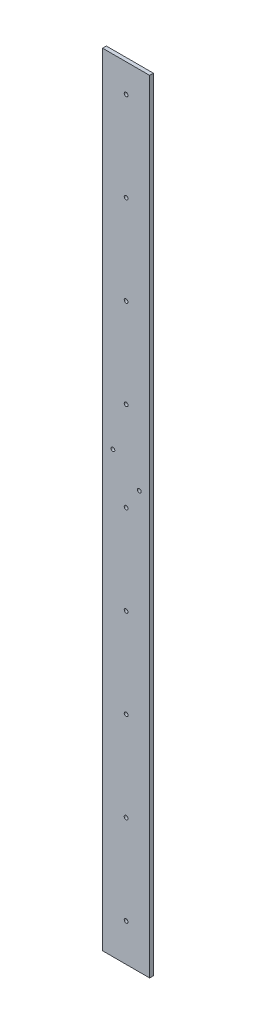
ISO-10303-21;
HEADER;
FILE_DESCRIPTION(('STEP AP214'),'2;1');
FILE_NAME('part.step','',(''),(''),'','','');
FILE_SCHEMA(('AUTOMOTIVE_DESIGN { 1 0 10303 214 1 1 1 1 }'));
ENDSEC;
DATA;
#1=APPLICATION_CONTEXT('core data for automotive mechanical design processes');
#2=APPLICATION_PROTOCOL_DEFINITION('international standard','automotive_design',2000,#1);
#3=PRODUCT_CONTEXT('',#1,'mechanical');
#4=PRODUCT('Part','Part','',(#3));
#5=PRODUCT_RELATED_PRODUCT_CATEGORY('part','',(#4));
#6=PRODUCT_DEFINITION_FORMATION('','',#4);
#7=PRODUCT_DEFINITION_CONTEXT('part definition',#1,'design');
#8=PRODUCT_DEFINITION('design','',#6,#7);
#9=PRODUCT_DEFINITION_SHAPE('','',#8);
#10=(LENGTH_UNIT() NAMED_UNIT(*) SI_UNIT(.MILLI.,.METRE.));
#11=(NAMED_UNIT(*) PLANE_ANGLE_UNIT() SI_UNIT($,.RADIAN.));
#12=(NAMED_UNIT(*) SI_UNIT($,.STERADIAN.) SOLID_ANGLE_UNIT());
#13=UNCERTAINTY_MEASURE_WITH_UNIT(LENGTH_MEASURE(1.E-05),#10,'distance_accuracy_value','');
#14=(GEOMETRIC_REPRESENTATION_CONTEXT(3) GLOBAL_UNCERTAINTY_ASSIGNED_CONTEXT((#13)) GLOBAL_UNIT_ASSIGNED_CONTEXT((#10,
#11,#12)) REPRESENTATION_CONTEXT('',''));
#15=CARTESIAN_POINT('',(0.,0.,0.));
#16=DIRECTION('',(0.,0.,1.));
#17=DIRECTION('',(1.,0.,0.));
#18=AXIS2_PLACEMENT_3D('',#15,#16,#17);
#19=CARTESIAN_POINT('',(-24.6280382553152,450.278971308513,4.));
#20=DIRECTION('',(1.,0.,0.));
#21=DIRECTION('',(0.,1.,0.));
#22=AXIS2_PLACEMENT_3D('',#19,#20,#21);
#23=PLANE('',#22);
#24=DIRECTION('',(0.,-1.,0.));
#25=VECTOR('',#24,1.);
#26=CARTESIAN_POINT('',(-24.6280382553152,450.278971308513,0.));
#27=LINE('',#26,#25);
#28=CARTESIAN_POINT('',(-24.6280382553152,450.278971308513,0.));
#29=VERTEX_POINT('',#28);
#30=CARTESIAN_POINT('',(-24.628038255312,-379.721028691487,0.));
#31=VERTEX_POINT('',#30);
#32=EDGE_CURVE('E82',#29,#31,#27,.T.);
#33=ORIENTED_EDGE('',*,*,#32,.T.);
#34=DIRECTION('',(0.,0.,1.));
#35=VECTOR('',#34,1.);
#36=CARTESIAN_POINT('',(-24.6280382553117,-379.721028691487,-0.00100000000000013));
#37=LINE('',#36,#35);
#38=CARTESIAN_POINT('',(-24.6280382553117,-379.721028691487,4.));
#39=VERTEX_POINT('',#38);
#40=EDGE_CURVE('E48',#31,#39,#37,.T.);
#41=ORIENTED_EDGE('',*,*,#40,.T.);
#42=DIRECTION('',(0.,-1.,0.));
#43=VECTOR('',#42,1.);
#44=CARTESIAN_POINT('',(-24.6280382553152,450.278971308513,4.));
#45=LINE('',#44,#43);
#46=CARTESIAN_POINT('',(-24.6280382553152,450.278971308513,4.));
#47=VERTEX_POINT('',#46);
#48=EDGE_CURVE('E77',#47,#39,#45,.T.);
#49=ORIENTED_EDGE('',*,*,#48,.F.);
#50=DIRECTION('',(0.,0.,-1.));
#51=VECTOR('',#50,1.);
#52=CARTESIAN_POINT('',(-24.6280382553152,450.278971308513,4.));
#53=LINE('',#52,#51);
#54=EDGE_CURVE('E41',#47,#29,#53,.T.);
#55=ORIENTED_EDGE('',*,*,#54,.T.);
#56=EDGE_LOOP('',(#33,#41,#49,#55));
#57=FACE_BOUND('',#56,.T.);
#58=ADVANCED_FACE('F34',(#57),#23,.F.);
#59=CARTESIAN_POINT('',(25.3719617446855,-449.721028691486,4.));
#60=DIRECTION('',(-1.,0.,0.));
#61=DIRECTION('',(0.,0.,1.));
#62=AXIS2_PLACEMENT_3D('',#59,#60,#61);
#63=PLANE('',#62);
#64=DIRECTION('',(0.,1.,0.));
#65=VECTOR('',#64,1.);
#66=CARTESIAN_POINT('',(25.3719617446855,-449.721028691486,4.));
#67=LINE('',#66,#65);
#68=CARTESIAN_POINT('',(25.3719617446855,-379.721028691487,4.));
#69=VERTEX_POINT('',#68);
#70=CARTESIAN_POINT('',(25.3719617446855,450.278971308513,4.));
#71=VERTEX_POINT('',#70);
#72=EDGE_CURVE('E90',#69,#71,#67,.T.);
#73=ORIENTED_EDGE('',*,*,#72,.F.);
#74=DIRECTION('',(0.,0.,1.));
#75=VECTOR('',#74,1.);
#76=CARTESIAN_POINT('',(25.3719617446855,-379.721028691487,-0.00100000000000013));
#77=LINE('',#76,#75);
#78=CARTESIAN_POINT('',(25.3719617446855,-379.721028691487,0.));
#79=VERTEX_POINT('',#78);
#80=EDGE_CURVE('E93',#79,#69,#77,.T.);
#81=ORIENTED_EDGE('',*,*,#80,.F.);
#82=DIRECTION('',(0.,1.,0.));
#83=VECTOR('',#82,1.);
#84=CARTESIAN_POINT('',(25.3719617446855,-449.721028691486,0.));
#85=LINE('',#84,#83);
#86=CARTESIAN_POINT('',(25.3719617446855,450.278971308513,0.));
#87=VERTEX_POINT('',#86);
#88=EDGE_CURVE('E78',#79,#87,#85,.T.);
#89=ORIENTED_EDGE('',*,*,#88,.T.);
#90=DIRECTION('',(0.,0.,-1.));
#91=VECTOR('',#90,1.);
#92=CARTESIAN_POINT('',(25.3719617446855,450.278971308513,4.));
#93=LINE('',#92,#91);
#94=EDGE_CURVE('E11',#71,#87,#93,.T.);
#95=ORIENTED_EDGE('',*,*,#94,.F.);
#96=EDGE_LOOP('',(#73,#81,#89,#95));
#97=FACE_BOUND('',#96,.T.);
#98=ADVANCED_FACE('F206',(#97),#63,.F.);
#99=CARTESIAN_POINT('',(25.3719617446855,450.278971308513,4.));
#100=DIRECTION('',(0.,-1.,0.));
#101=DIRECTION('',(0.,0.,-1.));
#102=AXIS2_PLACEMENT_3D('',#99,#100,#101);
#103=PLANE('',#102);
#104=DIRECTION('',(-1.,0.,0.));
#105=VECTOR('',#104,1.);
#106=CARTESIAN_POINT('',(25.3719617446855,450.278971308513,0.));
#107=LINE('',#106,#105);
#108=EDGE_CURVE('E69',#87,#29,#107,.T.);
#109=ORIENTED_EDGE('',*,*,#108,.T.);
#110=ORIENTED_EDGE('',*,*,#54,.F.);
#111=DIRECTION('',(-1.,0.,0.));
#112=VECTOR('',#111,1.);
#113=CARTESIAN_POINT('',(25.3719617446855,450.278971308513,4.));
#114=LINE('',#113,#112);
#115=EDGE_CURVE('E57',#71,#47,#114,.T.);
#116=ORIENTED_EDGE('',*,*,#115,.F.);
#117=ORIENTED_EDGE('',*,*,#94,.T.);
#118=EDGE_LOOP('',(#109,#110,#116,#117));
#119=FACE_BOUND('',#118,.T.);
#120=ADVANCED_FACE('F71',(#119),#103,.F.);
#121=CARTESIAN_POINT('',(0.,0.,4.));
#122=DIRECTION('',(0.,0.,1.));
#123=DIRECTION('',(1.,0.,0.));
#124=AXIS2_PLACEMENT_3D('',#121,#122,#123);
#125=PLANE('',#124);
#126=CARTESIAN_POINT('',(0.37196174468776,135.278971308442,4.));
#127=DIRECTION('',(0.,0.,-1.));
#128=DIRECTION('',(-1.,0.,0.));
#129=AXIS2_PLACEMENT_3D('',#126,#127,#128);
#130=CIRCLE('',#129,2.00000000002078);
#131=CARTESIAN_POINT('',(-1.62803825533302,135.278971308442,4.));
#132=VERTEX_POINT('',#131);
#133=EDGE_CURVE('E115',#132,#132,#130,.T.);
#134=ORIENTED_EDGE('',*,*,#133,.T.);
#135=EDGE_LOOP('',(#134));
#136=FACE_BOUND('',#135,.T.);
#137=CARTESIAN_POINT('',(0.371961744688755,40.2789713084417,4.));
#138=DIRECTION('',(0.,0.,-1.));
#139=DIRECTION('',(-1.,0.,0.));
#140=AXIS2_PLACEMENT_3D('',#137,#138,#139);
#141=CIRCLE('',#140,2.00000000002078);
#142=CARTESIAN_POINT('',(-1.62803825533202,40.2789713084417,4.));
#143=VERTEX_POINT('',#142);
#144=EDGE_CURVE('E122',#143,#143,#141,.T.);
#145=ORIENTED_EDGE('',*,*,#144,.T.);
#146=EDGE_LOOP('',(#145));
#147=FACE_BOUND('',#146,.T.);
#148=CARTESIAN_POINT('',(0.37196174468975,-54.7210286915583,4.));
#149=DIRECTION('',(0.,0.,-1.));
#150=DIRECTION('',(-1.,0.,0.));
#151=AXIS2_PLACEMENT_3D('',#148,#149,#150);
#152=CIRCLE('',#151,2.00000000002078);
#153=CARTESIAN_POINT('',(-1.62803825533103,-54.7210286915583,4.));
#154=VERTEX_POINT('',#153);
#155=EDGE_CURVE('E128',#154,#154,#152,.T.);
#156=ORIENTED_EDGE('',*,*,#155,.T.);
#157=EDGE_LOOP('',(#156));
#158=FACE_BOUND('',#157,.T.);
#159=CARTESIAN_POINT('',(0.371961744690745,-149.721028691558,4.));
#160=DIRECTION('',(0.,0.,-1.));
#161=DIRECTION('',(-1.,0.,0.));
#162=AXIS2_PLACEMENT_3D('',#159,#160,#161);
#163=CIRCLE('',#162,2.00000000002078);
#164=CARTESIAN_POINT('',(-1.62803825533003,-149.721028691558,4.));
#165=VERTEX_POINT('',#164);
#166=EDGE_CURVE('E109',#165,#165,#163,.T.);
#167=ORIENTED_EDGE('',*,*,#166,.T.);
#168=EDGE_LOOP('',(#167));
#169=FACE_BOUND('',#168,.T.);
#170=CARTESIAN_POINT('',(0.37196174469174,-244.721028691558,4.));
#171=DIRECTION('',(0.,0.,-1.));
#172=DIRECTION('',(-1.,0.,0.));
#173=AXIS2_PLACEMENT_3D('',#170,#171,#172);
#174=CIRCLE('',#173,2.00000000002078);
#175=CARTESIAN_POINT('',(-1.62803825532904,-244.721028691558,4.));
#176=VERTEX_POINT('',#175);
#177=EDGE_CURVE('E103',#176,#176,#174,.T.);
#178=ORIENTED_EDGE('',*,*,#177,.T.);
#179=EDGE_LOOP('',(#178));
#180=FACE_BOUND('',#179,.T.);
#181=CARTESIAN_POINT('',(0.371961744692735,-339.721028691558,4.));
#182=DIRECTION('',(0.,0.,-1.));
#183=DIRECTION('',(-1.,0.,0.));
#184=AXIS2_PLACEMENT_3D('',#181,#182,#183);
#185=CIRCLE('',#184,2.00000000002078);
#186=CARTESIAN_POINT('',(-1.62803825532804,-339.721028691558,4.));
#187=VERTEX_POINT('',#186);
#188=EDGE_CURVE('E157',#187,#187,#185,.T.);
#189=ORIENTED_EDGE('',*,*,#188,.T.);
#190=EDGE_LOOP('',(#189));
#191=FACE_BOUND('',#190,.T.);
#192=CARTESIAN_POINT('',(0.371961744684775,420.278971308442,4.));
#193=DIRECTION('',(0.,0.,-1.));
#194=DIRECTION('',(-1.,0.,0.));
#195=AXIS2_PLACEMENT_3D('',#192,#193,#194);
#196=CIRCLE('',#195,2.00000000002078);
#197=CARTESIAN_POINT('',(-1.628038255336,420.278971308442,4.));
#198=VERTEX_POINT('',#197);
#199=EDGE_CURVE('E147',#198,#198,#196,.T.);
#200=ORIENTED_EDGE('',*,*,#199,.T.);
#201=EDGE_LOOP('',(#200));
#202=FACE_BOUND('',#201,.T.);
#203=CARTESIAN_POINT('',(0.37196174468577,325.278971308442,4.));
#204=DIRECTION('',(0.,0.,-1.));
#205=DIRECTION('',(-1.,0.,0.));
#206=AXIS2_PLACEMENT_3D('',#203,#204,#205);
#207=CIRCLE('',#206,2.00000000002078);
#208=CARTESIAN_POINT('',(-1.62803825533501,325.278971308442,4.));
#209=VERTEX_POINT('',#208);
#210=EDGE_CURVE('E146',#209,#209,#207,.T.);
#211=ORIENTED_EDGE('',*,*,#210,.T.);
#212=EDGE_LOOP('',(#211));
#213=FACE_BOUND('',#212,.T.);
#214=CARTESIAN_POINT('',(0.371961744686765,230.278971308442,4.));
#215=DIRECTION('',(0.,0.,-1.));
#216=DIRECTION('',(-1.,0.,0.));
#217=AXIS2_PLACEMENT_3D('',#214,#215,#216);
#218=CIRCLE('',#217,2.00000000002078);
#219=CARTESIAN_POINT('',(-1.62803825533401,230.278971308442,4.));
#220=VERTEX_POINT('',#219);
#221=EDGE_CURVE('E116',#220,#220,#218,.T.);
#222=ORIENTED_EDGE('',*,*,#221,.T.);
#223=EDGE_LOOP('',(#222));
#224=FACE_BOUND('',#223,.T.);
#225=CARTESIAN_POINT('',(14.3719617446837,62.799089293571,4.));
#226=DIRECTION('',(0.,0.,-1.));
#227=DIRECTION('',(-1.,0.,0.));
#228=AXIS2_PLACEMENT_3D('',#225,#226,#227);
#229=CIRCLE('',#228,2.);
#230=CARTESIAN_POINT('',(12.3719617446837,62.799089293571,4.));
#231=VERTEX_POINT('',#230);
#232=EDGE_CURVE('E139',#231,#231,#229,.T.);
#233=ORIENTED_EDGE('',*,*,#232,.T.);
#234=EDGE_LOOP('',(#233));
#235=FACE_BOUND('',#234,.T.);
#236=CARTESIAN_POINT('',(-13.6280382553163,86.9275078754594,4.));
#237=DIRECTION('',(0.,0.,-1.));
#238=DIRECTION('',(-1.,0.,0.));
#239=AXIS2_PLACEMENT_3D('',#236,#237,#238);
#240=CIRCLE('',#239,2.);
#241=CARTESIAN_POINT('',(-15.6280382553163,86.9275078754594,4.));
#242=VERTEX_POINT('',#241);
#243=EDGE_CURVE('E99',#242,#242,#240,.T.);
#244=ORIENTED_EDGE('',*,*,#243,.T.);
#245=EDGE_LOOP('',(#244));
#246=FACE_BOUND('',#245,.T.);
#247=DIRECTION('',(-1.,0.,0.));
#248=VECTOR('',#247,1.);
#249=CARTESIAN_POINT('',(25.3719617446855,-379.721028691487,4.));
#250=LINE('',#249,#248);
#251=EDGE_CURVE('E96',#69,#39,#250,.T.);
#252=ORIENTED_EDGE('',*,*,#251,.F.);
#253=ORIENTED_EDGE('',*,*,#72,.T.);
#254=ORIENTED_EDGE('',*,*,#115,.T.);
#255=ORIENTED_EDGE('',*,*,#48,.T.);
#256=EDGE_LOOP('',(#252,#253,#254,#255));
#257=FACE_BOUND('',#256,.T.);
#258=ADVANCED_FACE('F166',(#136,#147,#158,#169,#180,#191,#202,#213,#224,#235,#246,#257),#125,.T.);
#259=CARTESIAN_POINT('',(0.,0.,0.));
#260=DIRECTION('',(0.,0.,1.));
#261=DIRECTION('',(1.,0.,0.));
#262=AXIS2_PLACEMENT_3D('',#259,#260,#261);
#263=PLANE('',#262);
#264=CARTESIAN_POINT('',(0.37196174468776,135.278971308442,0.));
#265=DIRECTION('',(0.,0.,-1.));
#266=DIRECTION('',(-1.,0.,0.));
#267=AXIS2_PLACEMENT_3D('',#264,#265,#266);
#268=CIRCLE('',#267,2.00000000002078);
#269=CARTESIAN_POINT('',(-1.62803825533302,135.278971308442,0.));
#270=VERTEX_POINT('',#269);
#271=EDGE_CURVE('E112',#270,#270,#268,.T.);
#272=ORIENTED_EDGE('',*,*,#271,.F.);
#273=EDGE_LOOP('',(#272));
#274=FACE_BOUND('',#273,.T.);
#275=CARTESIAN_POINT('',(0.371961744688755,40.2789713084417,0.));
#276=DIRECTION('',(0.,0.,-1.));
#277=DIRECTION('',(-1.,0.,0.));
#278=AXIS2_PLACEMENT_3D('',#275,#276,#277);
#279=CIRCLE('',#278,2.00000000002078);
#280=CARTESIAN_POINT('',(-1.62803825533202,40.2789713084417,0.));
#281=VERTEX_POINT('',#280);
#282=EDGE_CURVE('E119',#281,#281,#279,.T.);
#283=ORIENTED_EDGE('',*,*,#282,.F.);
#284=EDGE_LOOP('',(#283));
#285=FACE_BOUND('',#284,.T.);
#286=CARTESIAN_POINT('',(0.37196174468975,-54.7210286915583,0.));
#287=DIRECTION('',(0.,0.,-1.));
#288=DIRECTION('',(-1.,0.,0.));
#289=AXIS2_PLACEMENT_3D('',#286,#287,#288);
#290=CIRCLE('',#289,2.00000000002078);
#291=CARTESIAN_POINT('',(-1.62803825533103,-54.7210286915583,0.));
#292=VERTEX_POINT('',#291);
#293=EDGE_CURVE('E125',#292,#292,#290,.T.);
#294=ORIENTED_EDGE('',*,*,#293,.F.);
#295=EDGE_LOOP('',(#294));
#296=FACE_BOUND('',#295,.T.);
#297=CARTESIAN_POINT('',(0.371961744690745,-149.721028691558,0.));
#298=DIRECTION('',(0.,0.,-1.));
#299=DIRECTION('',(-1.,0.,0.));
#300=AXIS2_PLACEMENT_3D('',#297,#298,#299);
#301=CIRCLE('',#300,2.00000000002078);
#302=CARTESIAN_POINT('',(-1.62803825533003,-149.721028691558,0.));
#303=VERTEX_POINT('',#302);
#304=EDGE_CURVE('E131',#303,#303,#301,.T.);
#305=ORIENTED_EDGE('',*,*,#304,.F.);
#306=EDGE_LOOP('',(#305));
#307=FACE_BOUND('',#306,.T.);
#308=CARTESIAN_POINT('',(0.37196174469174,-244.721028691558,0.));
#309=DIRECTION('',(0.,0.,-1.));
#310=DIRECTION('',(-1.,0.,0.));
#311=AXIS2_PLACEMENT_3D('',#308,#309,#310);
#312=CIRCLE('',#311,2.00000000002078);
#313=CARTESIAN_POINT('',(-1.62803825532904,-244.721028691558,0.));
#314=VERTEX_POINT('',#313);
#315=EDGE_CURVE('E106',#314,#314,#312,.T.);
#316=ORIENTED_EDGE('',*,*,#315,.F.);
#317=EDGE_LOOP('',(#316));
#318=FACE_BOUND('',#317,.T.);
#319=CARTESIAN_POINT('',(0.371961744692735,-339.721028691558,0.));
#320=DIRECTION('',(0.,0.,-1.));
#321=DIRECTION('',(-1.,0.,0.));
#322=AXIS2_PLACEMENT_3D('',#319,#320,#321);
#323=CIRCLE('',#322,2.00000000002078);
#324=CARTESIAN_POINT('',(-1.62803825532804,-339.721028691558,0.));
#325=VERTEX_POINT('',#324);
#326=EDGE_CURVE('E142',#325,#325,#323,.T.);
#327=ORIENTED_EDGE('',*,*,#326,.F.);
#328=EDGE_LOOP('',(#327));
#329=FACE_BOUND('',#328,.T.);
#330=CARTESIAN_POINT('',(0.371961744684775,420.278971308442,0.));
#331=DIRECTION('',(0.,0.,-1.));
#332=DIRECTION('',(-1.,0.,0.));
#333=AXIS2_PLACEMENT_3D('',#330,#331,#332);
#334=CIRCLE('',#333,2.00000000002078);
#335=CARTESIAN_POINT('',(-1.628038255336,420.278971308442,0.));
#336=VERTEX_POINT('',#335);
#337=EDGE_CURVE('E160',#336,#336,#334,.T.);
#338=ORIENTED_EDGE('',*,*,#337,.F.);
#339=EDGE_LOOP('',(#338));
#340=FACE_BOUND('',#339,.T.);
#341=CARTESIAN_POINT('',(0.37196174468577,325.278971308442,0.));
#342=DIRECTION('',(0.,0.,-1.));
#343=DIRECTION('',(-1.,0.,0.));
#344=AXIS2_PLACEMENT_3D('',#341,#342,#343);
#345=CIRCLE('',#344,2.00000000002078);
#346=CARTESIAN_POINT('',(-1.62803825533501,325.278971308442,0.));
#347=VERTEX_POINT('',#346);
#348=EDGE_CURVE('E143',#347,#347,#345,.T.);
#349=ORIENTED_EDGE('',*,*,#348,.F.);
#350=EDGE_LOOP('',(#349));
#351=FACE_BOUND('',#350,.T.);
#352=CARTESIAN_POINT('',(0.371961744686765,230.278971308442,0.));
#353=DIRECTION('',(0.,0.,-1.));
#354=DIRECTION('',(-1.,0.,0.));
#355=AXIS2_PLACEMENT_3D('',#352,#353,#354);
#356=CIRCLE('',#355,2.00000000002078);
#357=CARTESIAN_POINT('',(-1.62803825533401,230.278971308442,0.));
#358=VERTEX_POINT('',#357);
#359=EDGE_CURVE('E150',#358,#358,#356,.T.);
#360=ORIENTED_EDGE('',*,*,#359,.F.);
#361=EDGE_LOOP('',(#360));
#362=FACE_BOUND('',#361,.T.);
#363=CARTESIAN_POINT('',(14.3719617446837,62.799089293571,0.));
#364=DIRECTION('',(0.,0.,-1.));
#365=DIRECTION('',(-1.,0.,0.));
#366=AXIS2_PLACEMENT_3D('',#363,#364,#365);
#367=CIRCLE('',#366,2.);
#368=CARTESIAN_POINT('',(12.3719617446837,62.799089293571,0.));
#369=VERTEX_POINT('',#368);
#370=EDGE_CURVE('E136',#369,#369,#367,.T.);
#371=ORIENTED_EDGE('',*,*,#370,.F.);
#372=EDGE_LOOP('',(#371));
#373=FACE_BOUND('',#372,.T.);
#374=CARTESIAN_POINT('',(-13.6280382553163,86.9275078754594,0.));
#375=DIRECTION('',(0.,0.,-1.));
#376=DIRECTION('',(-1.,0.,0.));
#377=AXIS2_PLACEMENT_3D('',#374,#375,#376);
#378=CIRCLE('',#377,2.);
#379=CARTESIAN_POINT('',(-15.6280382553163,86.9275078754594,0.));
#380=VERTEX_POINT('',#379);
#381=EDGE_CURVE('E100',#380,#380,#378,.T.);
#382=ORIENTED_EDGE('',*,*,#381,.F.);
#383=EDGE_LOOP('',(#382));
#384=FACE_BOUND('',#383,.T.);
#385=ORIENTED_EDGE('',*,*,#88,.F.);
#386=DIRECTION('',(1.,0.,0.));
#387=VECTOR('',#386,1.);
#388=CARTESIAN_POINT('',(25.3719617446855,-379.721028691487,0.));
#389=LINE('',#388,#387);
#390=EDGE_CURVE('E84',#31,#79,#389,.T.);
#391=ORIENTED_EDGE('',*,*,#390,.F.);
#392=ORIENTED_EDGE('',*,*,#32,.F.);
#393=ORIENTED_EDGE('',*,*,#108,.F.);
#394=EDGE_LOOP('',(#385,#391,#392,#393));
#395=FACE_BOUND('',#394,.T.);
#396=ADVANCED_FACE('F83',(#274,#285,#296,#307,#318,#329,#340,#351,#362,#373,#384,#395),#263,.F.);
#397=CARTESIAN_POINT('',(25.3719617446855,-379.721028691487,-0.00100000000000013));
#398=DIRECTION('',(0.,1.,0.));
#399=DIRECTION('',(0.,0.,1.));
#400=AXIS2_PLACEMENT_3D('',#397,#398,#399);
#401=PLANE('',#400);
#402=ORIENTED_EDGE('',*,*,#390,.T.);
#403=ORIENTED_EDGE('',*,*,#80,.T.);
#404=ORIENTED_EDGE('',*,*,#251,.T.);
#405=ORIENTED_EDGE('',*,*,#40,.F.);
#406=EDGE_LOOP('',(#402,#403,#404,#405));
#407=FACE_BOUND('',#406,.T.);
#408=ADVANCED_FACE('F179',(#407),#401,.F.);
#409=CARTESIAN_POINT('',(-13.6280382553163,86.9275078754594,4.));
#410=DIRECTION('',(0.,0.,-1.));
#411=DIRECTION('',(-1.,0.,0.));
#412=AXIS2_PLACEMENT_3D('',#409,#410,#411);
#413=CYLINDRICAL_SURFACE('',#412,2.);
#414=ORIENTED_EDGE('',*,*,#243,.F.);
#415=EDGE_LOOP('',(#414));
#416=FACE_BOUND('',#415,.T.);
#417=ORIENTED_EDGE('',*,*,#381,.T.);
#418=EDGE_LOOP('',(#417));
#419=FACE_BOUND('',#418,.T.);
#420=ADVANCED_FACE('F190',(#416,#419),#413,.F.);
#421=CARTESIAN_POINT('',(14.3719617446837,62.799089293571,4.));
#422=DIRECTION('',(0.,0.,-1.));
#423=DIRECTION('',(-1.,0.,0.));
#424=AXIS2_PLACEMENT_3D('',#421,#422,#423);
#425=CYLINDRICAL_SURFACE('',#424,2.);
#426=ORIENTED_EDGE('',*,*,#232,.F.);
#427=EDGE_LOOP('',(#426));
#428=FACE_BOUND('',#427,.T.);
#429=ORIENTED_EDGE('',*,*,#370,.T.);
#430=EDGE_LOOP('',(#429));
#431=FACE_BOUND('',#430,.T.);
#432=ADVANCED_FACE('F192',(#428,#431),#425,.F.);
#433=CARTESIAN_POINT('',(0.371961744686765,230.278971308442,4.));
#434=DIRECTION('',(0.,0.,-1.));
#435=DIRECTION('',(-1.,0.,0.));
#436=AXIS2_PLACEMENT_3D('',#433,#434,#435);
#437=CYLINDRICAL_SURFACE('',#436,2.00000000002078);
#438=ORIENTED_EDGE('',*,*,#221,.F.);
#439=EDGE_LOOP('',(#438));
#440=FACE_BOUND('',#439,.T.);
#441=ORIENTED_EDGE('',*,*,#359,.T.);
#442=EDGE_LOOP('',(#441));
#443=FACE_BOUND('',#442,.T.);
#444=ADVANCED_FACE('F199',(#440,#443),#437,.F.);
#445=CARTESIAN_POINT('',(0.37196174468577,325.278971308442,4.));
#446=DIRECTION('',(0.,0.,-1.));
#447=DIRECTION('',(-1.,0.,0.));
#448=AXIS2_PLACEMENT_3D('',#445,#446,#447);
#449=CYLINDRICAL_SURFACE('',#448,2.00000000002078);
#450=ORIENTED_EDGE('',*,*,#210,.F.);
#451=EDGE_LOOP('',(#450));
#452=FACE_BOUND('',#451,.T.);
#453=ORIENTED_EDGE('',*,*,#348,.T.);
#454=EDGE_LOOP('',(#453));
#455=FACE_BOUND('',#454,.T.);
#456=ADVANCED_FACE('F173',(#452,#455),#449,.F.);
#457=CARTESIAN_POINT('',(0.371961744684775,420.278971308442,4.));
#458=DIRECTION('',(0.,0.,-1.));
#459=DIRECTION('',(-1.,0.,0.));
#460=AXIS2_PLACEMENT_3D('',#457,#458,#459);
#461=CYLINDRICAL_SURFACE('',#460,2.00000000002078);
#462=ORIENTED_EDGE('',*,*,#199,.F.);
#463=EDGE_LOOP('',(#462));
#464=FACE_BOUND('',#463,.T.);
#465=ORIENTED_EDGE('',*,*,#337,.T.);
#466=EDGE_LOOP('',(#465));
#467=FACE_BOUND('',#466,.T.);
#468=ADVANCED_FACE('F169',(#464,#467),#461,.F.);
#469=CARTESIAN_POINT('',(0.371961744692735,-339.721028691558,4.));
#470=DIRECTION('',(0.,0.,-1.));
#471=DIRECTION('',(-1.,0.,0.));
#472=AXIS2_PLACEMENT_3D('',#469,#470,#471);
#473=CYLINDRICAL_SURFACE('',#472,2.00000000002078);
#474=ORIENTED_EDGE('',*,*,#188,.F.);
#475=EDGE_LOOP('',(#474));
#476=FACE_BOUND('',#475,.T.);
#477=ORIENTED_EDGE('',*,*,#326,.T.);
#478=EDGE_LOOP('',(#477));
#479=FACE_BOUND('',#478,.T.);
#480=ADVANCED_FACE('F172',(#476,#479),#473,.F.);
#481=CARTESIAN_POINT('',(0.37196174469174,-244.721028691558,4.));
#482=DIRECTION('',(0.,0.,-1.));
#483=DIRECTION('',(-1.,0.,0.));
#484=AXIS2_PLACEMENT_3D('',#481,#482,#483);
#485=CYLINDRICAL_SURFACE('',#484,2.00000000002078);
#486=ORIENTED_EDGE('',*,*,#177,.F.);
#487=EDGE_LOOP('',(#486));
#488=FACE_BOUND('',#487,.T.);
#489=ORIENTED_EDGE('',*,*,#315,.T.);
#490=EDGE_LOOP('',(#489));
#491=FACE_BOUND('',#490,.T.);
#492=ADVANCED_FACE('F237',(#488,#491),#485,.F.);
#493=CARTESIAN_POINT('',(0.371961744690745,-149.721028691558,4.));
#494=DIRECTION('',(0.,0.,-1.));
#495=DIRECTION('',(-1.,0.,0.));
#496=AXIS2_PLACEMENT_3D('',#493,#494,#495);
#497=CYLINDRICAL_SURFACE('',#496,2.00000000002078);
#498=ORIENTED_EDGE('',*,*,#166,.F.);
#499=EDGE_LOOP('',(#498));
#500=FACE_BOUND('',#499,.T.);
#501=ORIENTED_EDGE('',*,*,#304,.T.);
#502=EDGE_LOOP('',(#501));
#503=FACE_BOUND('',#502,.T.);
#504=ADVANCED_FACE('F244',(#500,#503),#497,.F.);
#505=CARTESIAN_POINT('',(0.37196174468975,-54.7210286915583,4.));
#506=DIRECTION('',(0.,0.,-1.));
#507=DIRECTION('',(-1.,0.,0.));
#508=AXIS2_PLACEMENT_3D('',#505,#506,#507);
#509=CYLINDRICAL_SURFACE('',#508,2.00000000002078);
#510=ORIENTED_EDGE('',*,*,#155,.F.);
#511=EDGE_LOOP('',(#510));
#512=FACE_BOUND('',#511,.T.);
#513=ORIENTED_EDGE('',*,*,#293,.T.);
#514=EDGE_LOOP('',(#513));
#515=FACE_BOUND('',#514,.T.);
#516=ADVANCED_FACE('F255',(#512,#515),#509,.F.);
#517=CARTESIAN_POINT('',(0.371961744688755,40.2789713084417,4.));
#518=DIRECTION('',(0.,0.,-1.));
#519=DIRECTION('',(-1.,0.,0.));
#520=AXIS2_PLACEMENT_3D('',#517,#518,#519);
#521=CYLINDRICAL_SURFACE('',#520,2.00000000002078);
#522=ORIENTED_EDGE('',*,*,#144,.F.);
#523=EDGE_LOOP('',(#522));
#524=FACE_BOUND('',#523,.T.);
#525=ORIENTED_EDGE('',*,*,#282,.T.);
#526=EDGE_LOOP('',(#525));
#527=FACE_BOUND('',#526,.T.);
#528=ADVANCED_FACE('F259',(#524,#527),#521,.F.);
#529=CARTESIAN_POINT('',(0.37196174468776,135.278971308442,4.));
#530=DIRECTION('',(0.,0.,-1.));
#531=DIRECTION('',(-1.,0.,0.));
#532=AXIS2_PLACEMENT_3D('',#529,#530,#531);
#533=CYLINDRICAL_SURFACE('',#532,2.00000000002078);
#534=ORIENTED_EDGE('',*,*,#133,.F.);
#535=EDGE_LOOP('',(#534));
#536=FACE_BOUND('',#535,.T.);
#537=ORIENTED_EDGE('',*,*,#271,.T.);
#538=EDGE_LOOP('',(#537));
#539=FACE_BOUND('',#538,.T.);
#540=ADVANCED_FACE('F263',(#536,#539),#533,.F.);
#541=CLOSED_SHELL('',(#58,#98,#120,#258,#396,#408,#420,#432,#444,#456,#468,#480,#492,#504,#516,
#528,#540));
#542=MANIFOLD_SOLID_BREP('B2',#541);
#543=ADVANCED_BREP_SHAPE_REPRESENTATION('',(#18,#542),#14);
#544=SHAPE_DEFINITION_REPRESENTATION(#9,#543);
ENDSEC;
END-ISO-10303-21;
